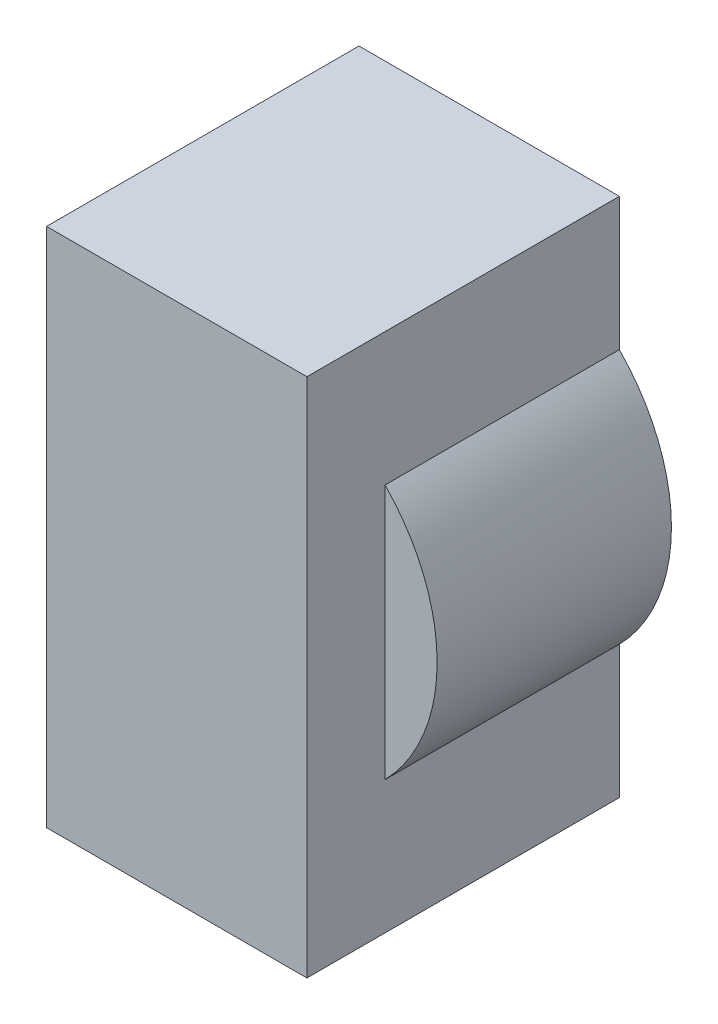
ISO-10303-21;
HEADER;
FILE_DESCRIPTION(('STEP AP214'),'2;1');
FILE_NAME('part.step','',(''),(''),'','','');
FILE_SCHEMA(('AUTOMOTIVE_DESIGN { 1 0 10303 214 1 1 1 1 }'));
ENDSEC;
DATA;
#1=APPLICATION_CONTEXT('core data for automotive mechanical design processes');
#2=APPLICATION_PROTOCOL_DEFINITION('international standard','automotive_design',2000,#1);
#3=PRODUCT_CONTEXT('',#1,'mechanical');
#4=PRODUCT('Part','Part','',(#3));
#5=PRODUCT_RELATED_PRODUCT_CATEGORY('part','',(#4));
#6=PRODUCT_DEFINITION_FORMATION('','',#4);
#7=PRODUCT_DEFINITION_CONTEXT('part definition',#1,'design');
#8=PRODUCT_DEFINITION('design','',#6,#7);
#9=PRODUCT_DEFINITION_SHAPE('','',#8);
#10=(LENGTH_UNIT() NAMED_UNIT(*) SI_UNIT(.MILLI.,.METRE.));
#11=(NAMED_UNIT(*) PLANE_ANGLE_UNIT() SI_UNIT($,.RADIAN.));
#12=(NAMED_UNIT(*) SI_UNIT($,.STERADIAN.) SOLID_ANGLE_UNIT());
#13=UNCERTAINTY_MEASURE_WITH_UNIT(LENGTH_MEASURE(1.E-05),#10,'distance_accuracy_value','');
#14=(GEOMETRIC_REPRESENTATION_CONTEXT(3) GLOBAL_UNCERTAINTY_ASSIGNED_CONTEXT((#13)) GLOBAL_UNIT_ASSIGNED_CONTEXT((#10,
#11,#12)) REPRESENTATION_CONTEXT('',''));
#15=CARTESIAN_POINT('',(0.,0.,0.));
#16=DIRECTION('',(0.,0.,1.));
#17=DIRECTION('',(1.,0.,0.));
#18=AXIS2_PLACEMENT_3D('',#15,#16,#17);
#19=CARTESIAN_POINT('',(-2.11892560124397,-0.126901039489056,6.));
#20=DIRECTION('',(1.,0.,0.));
#21=DIRECTION('',(0.,1.,4.37113882867379E-08));
#22=AXIS2_PLACEMENT_3D('',#19,#20,#21);
#23=PLANE('',#22);
#24=DIRECTION('',(0.,4.37113880893649E-08,-0.999999999999999));
#25=VECTOR('',#24,1.);
#26=CARTESIAN_POINT('',(-2.11892560124397,-2.57639071670497,4.4999998929294));
#27=LINE('',#26,#25);
#28=CARTESIAN_POINT('',(-2.11892560124397,-2.57639071670497,4.4999998929294));
#29=VERTEX_POINT('',#28);
#30=CARTESIAN_POINT('',(-2.11892560124397,-2.57639052000373,-1.0707059725117E-07));
#31=VERTEX_POINT('',#30);
#32=EDGE_CURVE('E11',#29,#31,#27,.T.);
#33=ORIENTED_EDGE('',*,*,#32,.T.);
#34=DIRECTION('',(0.,-0.999999999999999,-4.37113882867379E-08));
#35=VECTOR('',#34,1.);
#36=CARTESIAN_POINT('',(-2.11892560124397,-2.57639052000373,-1.0707059725117E-07));
#37=LINE('',#36,#35);
#38=CARTESIAN_POINT('',(-2.11892560124397,-5.12690077722073,-2.1855694143369E-07));
#39=VERTEX_POINT('',#38);
#40=EDGE_CURVE('E141',#31,#39,#37,.T.);
#41=ORIENTED_EDGE('',*,*,#40,.T.);
#42=DIRECTION('',(0.,4.37113882867379E-08,-0.999999999999999));
#43=VECTOR('',#42,1.);
#44=CARTESIAN_POINT('',(-2.11892560124397,-5.12690103948906,5.99999978144306));
#45=LINE('',#44,#43);
#46=CARTESIAN_POINT('',(-2.11892560124397,-5.12690103948906,5.99999978144306));
#47=VERTEX_POINT('',#46);
#48=EDGE_CURVE('E132',#47,#39,#45,.T.);
#49=ORIENTED_EDGE('',*,*,#48,.F.);
#50=DIRECTION('',(0.,-0.999999999999999,-4.37113882867379E-08));
#51=VECTOR('',#50,1.);
#52=CARTESIAN_POINT('',(-2.11892560124397,4.87309896051094,6.00000021855694));
#53=LINE('',#52,#51);
#54=CARTESIAN_POINT('',(-2.11892560124397,4.87309896051094,6.00000021855694));
#55=VERTEX_POINT('',#54);
#56=EDGE_CURVE('E121',#55,#47,#53,.T.);
#57=ORIENTED_EDGE('',*,*,#56,.F.);
#58=DIRECTION('',(0.,4.37113882867379E-08,-0.999999999999999));
#59=VECTOR('',#58,1.);
#60=CARTESIAN_POINT('',(-2.11892560124397,4.87309896051094,6.00000021855694));
#61=LINE('',#60,#59);
#62=CARTESIAN_POINT('',(-2.11892560124397,4.87309922277927,2.1855694143369E-07));
#63=VERTEX_POINT('',#62);
#64=EDGE_CURVE('E127',#55,#63,#61,.T.);
#65=ORIENTED_EDGE('',*,*,#64,.T.);
#66=DIRECTION('',(0.,-0.999999999999999,-4.37113882867379E-08));
#67=VECTOR('',#66,1.);
#68=CARTESIAN_POINT('',(-2.11892560124397,4.87309922277927,2.1855694143369E-07));
#69=LINE('',#68,#67);
#70=CARTESIAN_POINT('',(-2.11892560124397,2.32258896556227,1.0707059725117E-07));
#71=VERTEX_POINT('',#70);
#72=EDGE_CURVE('E101',#63,#71,#69,.T.);
#73=ORIENTED_EDGE('',*,*,#72,.T.);
#74=DIRECTION('',(0.,4.37113884841109E-08,-0.999999999999999));
#75=VECTOR('',#74,1.);
#76=CARTESIAN_POINT('',(-2.11892560124397,2.32258876886103,4.5000001070706));
#77=LINE('',#76,#75);
#78=CARTESIAN_POINT('',(-2.11892560124397,2.32258876886103,4.5000001070706));
#79=VERTEX_POINT('',#78);
#80=EDGE_CURVE('E79',#79,#71,#77,.T.);
#81=ORIENTED_EDGE('',*,*,#80,.F.);
#82=DIRECTION('',(0.,-0.999999999999999,-4.37113881160721E-08));
#83=VECTOR('',#82,1.);
#84=CARTESIAN_POINT('',(-2.11892560124397,2.32258876886103,4.5000001070706));
#85=LINE('',#84,#83);
#86=EDGE_CURVE('E77',#79,#29,#85,.T.);
#87=ORIENTED_EDGE('',*,*,#86,.T.);
#88=EDGE_LOOP('',(#33,#41,#49,#57,#65,#73,#81,#87));
#89=FACE_BOUND('',#88,.T.);
#90=ADVANCED_FACE('F17',(#89),#23,.F.);
#91=CARTESIAN_POINT('',(2.88107439875603,-0.126901039489056,6.));
#92=DIRECTION('',(1.,0.,0.));
#93=DIRECTION('',(0.,1.,4.37113882867379E-08));
#94=AXIS2_PLACEMENT_3D('',#91,#92,#93);
#95=PLANE('',#94);
#96=DIRECTION('',(0.,-0.999999999999999,-4.37113882867379E-08));
#97=VECTOR('',#96,1.);
#98=CARTESIAN_POINT('',(2.88107439875603,-2.57639052000373,-1.0707059725117E-07));
#99=LINE('',#98,#97);
#100=CARTESIAN_POINT('',(2.88107439875603,-2.57639052000373,-1.0707059725117E-07));
#101=VERTEX_POINT('',#100);
#102=CARTESIAN_POINT('',(2.88107439875603,-5.12690077722073,-2.1855694143369E-07));
#103=VERTEX_POINT('',#102);
#104=EDGE_CURVE('E24',#101,#103,#99,.T.);
#105=ORIENTED_EDGE('',*,*,#104,.F.);
#106=DIRECTION('',(0.,4.37113880893649E-08,-0.999999999999999));
#107=VECTOR('',#106,1.);
#108=CARTESIAN_POINT('',(2.88107439875603,-2.57639071670497,4.4999998929294));
#109=LINE('',#108,#107);
#110=CARTESIAN_POINT('',(2.88107439875603,-2.57639071670497,4.4999998929294));
#111=VERTEX_POINT('',#110);
#112=EDGE_CURVE('E135',#111,#101,#109,.T.);
#113=ORIENTED_EDGE('',*,*,#112,.F.);
#114=DIRECTION('',(0.,-0.999999999999999,-4.37113881160721E-08));
#115=VECTOR('',#114,1.);
#116=CARTESIAN_POINT('',(2.88107439875603,2.32258876886103,4.5000001070706));
#117=LINE('',#116,#115);
#118=CARTESIAN_POINT('',(2.88107439875603,2.32258876886103,4.5000001070706));
#119=VERTEX_POINT('',#118);
#120=EDGE_CURVE('E124',#119,#111,#117,.T.);
#121=ORIENTED_EDGE('',*,*,#120,.F.);
#122=DIRECTION('',(0.,4.37113884841109E-08,-0.999999999999999));
#123=VECTOR('',#122,1.);
#124=CARTESIAN_POINT('',(2.88107439875603,2.32258876886103,4.5000001070706));
#125=LINE('',#124,#123);
#126=CARTESIAN_POINT('',(2.88107439875603,2.32258896556227,1.0707059725117E-07));
#127=VERTEX_POINT('',#126);
#128=EDGE_CURVE('E111',#119,#127,#125,.T.);
#129=ORIENTED_EDGE('',*,*,#128,.T.);
#130=DIRECTION('',(0.,-0.999999999999999,-4.37113882867379E-08));
#131=VECTOR('',#130,1.);
#132=CARTESIAN_POINT('',(2.88107439875603,4.87309922277927,2.1855694143369E-07));
#133=LINE('',#132,#131);
#134=CARTESIAN_POINT('',(2.88107439875603,4.87309922277927,2.1855694143369E-07));
#135=VERTEX_POINT('',#134);
#136=EDGE_CURVE('E108',#135,#127,#133,.T.);
#137=ORIENTED_EDGE('',*,*,#136,.F.);
#138=DIRECTION('',(0.,4.37113882867379E-08,-0.999999999999999));
#139=VECTOR('',#138,1.);
#140=CARTESIAN_POINT('',(2.88107439875603,4.87309896051094,6.00000021855694));
#141=LINE('',#140,#139);
#142=CARTESIAN_POINT('',(2.88107439875603,4.87309896051094,6.00000021855694));
#143=VERTEX_POINT('',#142);
#144=EDGE_CURVE('E103',#143,#135,#141,.T.);
#145=ORIENTED_EDGE('',*,*,#144,.F.);
#146=DIRECTION('',(0.,-0.999999999999999,-4.37113882867379E-08));
#147=VECTOR('',#146,1.);
#148=CARTESIAN_POINT('',(2.88107439875603,4.87309896051094,6.00000021855694));
#149=LINE('',#148,#147);
#150=CARTESIAN_POINT('',(2.88107439875603,-5.12690103948906,5.99999978144306));
#151=VERTEX_POINT('',#150);
#152=EDGE_CURVE('E118',#143,#151,#149,.T.);
#153=ORIENTED_EDGE('',*,*,#152,.T.);
#154=DIRECTION('',(0.,4.37113882867379E-08,-0.999999999999999));
#155=VECTOR('',#154,1.);
#156=CARTESIAN_POINT('',(2.88107439875603,-5.12690103948906,5.99999978144306));
#157=LINE('',#156,#155);
#158=EDGE_CURVE('E116',#151,#103,#157,.T.);
#159=ORIENTED_EDGE('',*,*,#158,.T.);
#160=EDGE_LOOP('',(#105,#113,#121,#129,#137,#145,#153,#159));
#161=FACE_BOUND('',#160,.T.);
#162=ADVANCED_FACE('F145',(#161),#95,.T.);
#163=CARTESIAN_POINT('',(0.381074398756027,4.87309896051094,6.00000021855694));
#164=DIRECTION('',(0.,1.,4.37113882867379E-08));
#165=DIRECTION('',(-1.,0.,0.));
#166=AXIS2_PLACEMENT_3D('',#163,#164,#165);
#167=PLANE('',#166);
#168=DIRECTION('',(1.,0.,0.));
#169=VECTOR('',#168,1.);
#170=CARTESIAN_POINT('',(-2.11892560124397,4.87309922277927,2.1855694143369E-07));
#171=LINE('',#170,#169);
#172=EDGE_CURVE('E138',#63,#135,#171,.T.);
#173=ORIENTED_EDGE('',*,*,#172,.F.);
#174=ORIENTED_EDGE('',*,*,#64,.F.);
#175=DIRECTION('',(1.,0.,0.));
#176=VECTOR('',#175,1.);
#177=CARTESIAN_POINT('',(-2.11892560124397,4.87309896051094,6.00000021855694));
#178=LINE('',#177,#176);
#179=EDGE_CURVE('E113',#55,#143,#178,.T.);
#180=ORIENTED_EDGE('',*,*,#179,.T.);
#181=ORIENTED_EDGE('',*,*,#144,.T.);
#182=EDGE_LOOP('',(#173,#174,#180,#181));
#183=FACE_BOUND('',#182,.T.);
#184=ADVANCED_FACE('F157',(#183),#167,.T.);
#185=CARTESIAN_POINT('',(0.381074398756027,-5.12690103948906,5.99999978144306));
#186=DIRECTION('',(0.,1.,4.37113882867379E-08));
#187=DIRECTION('',(-1.,0.,0.));
#188=AXIS2_PLACEMENT_3D('',#185,#186,#187);
#189=PLANE('',#188);
#190=DIRECTION('',(1.,0.,0.));
#191=VECTOR('',#190,1.);
#192=CARTESIAN_POINT('',(-2.11892560124397,-5.12690077722073,-2.1855694143369E-07));
#193=LINE('',#192,#191);
#194=EDGE_CURVE('E130',#39,#103,#193,.T.);
#195=ORIENTED_EDGE('',*,*,#194,.T.);
#196=ORIENTED_EDGE('',*,*,#158,.F.);
#197=DIRECTION('',(1.,0.,0.));
#198=VECTOR('',#197,1.);
#199=CARTESIAN_POINT('',(-2.11892560124397,-5.12690103948906,5.99999978144306));
#200=LINE('',#199,#198);
#201=EDGE_CURVE('E105',#47,#151,#200,.T.);
#202=ORIENTED_EDGE('',*,*,#201,.F.);
#203=ORIENTED_EDGE('',*,*,#48,.T.);
#204=EDGE_LOOP('',(#195,#196,#202,#203));
#205=FACE_BOUND('',#204,.T.);
#206=ADVANCED_FACE('F149',(#205),#189,.F.);
#207=CARTESIAN_POINT('',(0.381074398756027,-0.126901039489056,6.));
#208=DIRECTION('',(0.,-4.37113882867379E-08,1.));
#209=DIRECTION('',(0.,-1.,-4.37113882867379E-08));
#210=AXIS2_PLACEMENT_3D('',#207,#208,#209);
#211=PLANE('',#210);
#212=ORIENTED_EDGE('',*,*,#152,.F.);
#213=ORIENTED_EDGE('',*,*,#179,.F.);
#214=ORIENTED_EDGE('',*,*,#56,.T.);
#215=ORIENTED_EDGE('',*,*,#201,.T.);
#216=EDGE_LOOP('',(#212,#213,#214,#215));
#217=FACE_BOUND('',#216,.T.);
#218=ADVANCED_FACE('F151',(#217),#211,.T.);
#219=CARTESIAN_POINT('',(0.381074398756027,-0.126900777220726,0.));
#220=DIRECTION('',(0.,-4.37113882867379E-08,1.));
#221=DIRECTION('',(0.,-1.,-4.37113882867379E-08));
#222=AXIS2_PLACEMENT_3D('',#219,#220,#221);
#223=PLANE('',#222);
#224=ORIENTED_EDGE('',*,*,#136,.T.);
#225=CARTESIAN_POINT('',(0.381074398756024,-0.126900777220726,0.));
#226=DIRECTION('',(0.,-4.37113882867379E-08,1.));
#227=DIRECTION('',(0.71428571428574,-0.699854212223739,-3.05915992146209E-08));
#228=AXIS2_PLACEMENT_3D('',#225,#226,#227);
#229=CIRCLE('',#228,3.5);
#230=EDGE_CURVE('E98',#101,#127,#229,.T.);
#231=ORIENTED_EDGE('',*,*,#230,.F.);
#232=ORIENTED_EDGE('',*,*,#104,.T.);
#233=ORIENTED_EDGE('',*,*,#194,.F.);
#234=ORIENTED_EDGE('',*,*,#40,.F.);
#235=CARTESIAN_POINT('',(0.381074398756024,-0.126900777220726,0.));
#236=DIRECTION('',(0.,-4.37113882867379E-08,1.));
#237=DIRECTION('',(-0.714285714285739,0.69985421222374,3.0591599214621E-08));
#238=AXIS2_PLACEMENT_3D('',#235,#236,#237);
#239=CIRCLE('',#238,3.5);
#240=EDGE_CURVE('E83',#71,#31,#239,.T.);
#241=ORIENTED_EDGE('',*,*,#240,.F.);
#242=ORIENTED_EDGE('',*,*,#72,.F.);
#243=ORIENTED_EDGE('',*,*,#172,.T.);
#244=EDGE_LOOP('',(#224,#231,#232,#233,#234,#241,#242,#243));
#245=FACE_BOUND('',#244,.T.);
#246=ADVANCED_FACE('F144',(#245),#223,.F.);
#247=CARTESIAN_POINT('',(0.381074398756024,-0.126900973921973,4.5));
#248=DIRECTION('',(0.,4.37113882867379E-08,-1.));
#249=DIRECTION('',(0.,1.,4.37113882867379E-08));
#250=AXIS2_PLACEMENT_3D('',#247,#248,#249);
#251=CYLINDRICAL_SURFACE('',#250,3.5);
#252=ORIENTED_EDGE('',*,*,#230,.T.);
#253=ORIENTED_EDGE('',*,*,#128,.F.);
#254=CARTESIAN_POINT('',(0.381074398756024,-0.126900973921973,4.5));
#255=DIRECTION('',(0.,-4.37113882867379E-08,1.));
#256=DIRECTION('',(0.71428571428574,-0.699854212223739,-3.05915992146209E-08));
#257=AXIS2_PLACEMENT_3D('',#254,#255,#256);
#258=CIRCLE('',#257,3.5);
#259=EDGE_CURVE('E91',#111,#119,#258,.T.);
#260=ORIENTED_EDGE('',*,*,#259,.F.);
#261=ORIENTED_EDGE('',*,*,#112,.T.);
#262=EDGE_LOOP('',(#252,#253,#260,#261));
#263=FACE_BOUND('',#262,.T.);
#264=ADVANCED_FACE('F161',(#263),#251,.T.);
#265=CARTESIAN_POINT('',(0.381074398756027,-0.126900973921973,4.5));
#266=DIRECTION('',(0.,-4.37113882867379E-08,1.));
#267=DIRECTION('',(0.,-1.,-4.37113882867379E-08));
#268=AXIS2_PLACEMENT_3D('',#265,#266,#267);
#269=PLANE('',#268);
#270=ORIENTED_EDGE('',*,*,#120,.T.);
#271=ORIENTED_EDGE('',*,*,#259,.T.);
#272=EDGE_LOOP('',(#270,#271));
#273=FACE_BOUND('',#272,.T.);
#274=ADVANCED_FACE('F163',(#273),#269,.T.);
#275=CARTESIAN_POINT('',(0.381074398756024,-0.126900973921973,4.5));
#276=DIRECTION('',(0.,4.37113882867379E-08,-1.));
#277=DIRECTION('',(0.,1.,4.37113882867379E-08));
#278=AXIS2_PLACEMENT_3D('',#275,#276,#277);
#279=CYLINDRICAL_SURFACE('',#278,3.5);
#280=ORIENTED_EDGE('',*,*,#240,.T.);
#281=ORIENTED_EDGE('',*,*,#32,.F.);
#282=CARTESIAN_POINT('',(0.381074398756024,-0.126900973921973,4.5));
#283=DIRECTION('',(0.,-4.37113882867379E-08,1.));
#284=DIRECTION('',(-0.714285714285739,0.69985421222374,3.0591599214621E-08));
#285=AXIS2_PLACEMENT_3D('',#282,#283,#284);
#286=CIRCLE('',#285,3.5);
#287=EDGE_CURVE('E87',#79,#29,#286,.T.);
#288=ORIENTED_EDGE('',*,*,#287,.F.);
#289=ORIENTED_EDGE('',*,*,#80,.T.);
#290=EDGE_LOOP('',(#280,#281,#288,#289));
#291=FACE_BOUND('',#290,.T.);
#292=ADVANCED_FACE('F86',(#291),#279,.T.);
#293=CARTESIAN_POINT('',(0.381074398756027,-0.126900973921973,4.5));
#294=DIRECTION('',(0.,-4.37113882867379E-08,1.));
#295=DIRECTION('',(0.,-1.,-4.37113882867379E-08));
#296=AXIS2_PLACEMENT_3D('',#293,#294,#295);
#297=PLANE('',#296);
#298=ORIENTED_EDGE('',*,*,#86,.F.);
#299=ORIENTED_EDGE('',*,*,#287,.T.);
#300=EDGE_LOOP('',(#298,#299));
#301=FACE_BOUND('',#300,.T.);
#302=ADVANCED_FACE('F90',(#301),#297,.T.);
#303=CLOSED_SHELL('',(#90,#162,#184,#206,#218,#246,#264,#274,#292,#302));
#304=MANIFOLD_SOLID_BREP('B1',#303);
#305=ADVANCED_BREP_SHAPE_REPRESENTATION('',(#18,#304),#14);
#306=SHAPE_DEFINITION_REPRESENTATION(#9,#305);
ENDSEC;
END-ISO-10303-21;
